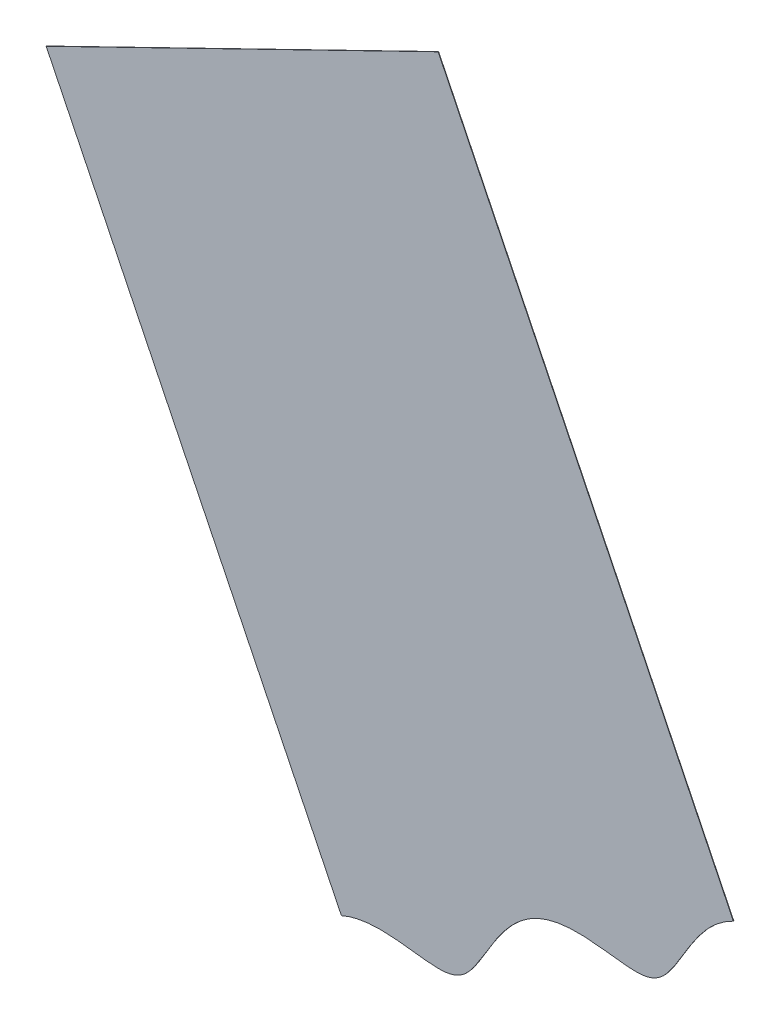
ISO-10303-21;
HEADER;
FILE_DESCRIPTION(('STEP AP214'),'2;1');
FILE_NAME('part.step','',(''),(''),'','','');
FILE_SCHEMA(('AUTOMOTIVE_DESIGN { 1 0 10303 214 1 1 1 1 }'));
ENDSEC;
DATA;
#1=APPLICATION_CONTEXT('core data for automotive mechanical design processes');
#2=APPLICATION_PROTOCOL_DEFINITION('international standard','automotive_design',2000,#1);
#3=PRODUCT_CONTEXT('',#1,'mechanical');
#4=PRODUCT('Part','Part','',(#3));
#5=PRODUCT_RELATED_PRODUCT_CATEGORY('part','',(#4));
#6=PRODUCT_DEFINITION_FORMATION('','',#4);
#7=PRODUCT_DEFINITION_CONTEXT('part definition',#1,'design');
#8=PRODUCT_DEFINITION('design','',#6,#7);
#9=PRODUCT_DEFINITION_SHAPE('','',#8);
#10=(LENGTH_UNIT() NAMED_UNIT(*) SI_UNIT(.MILLI.,.METRE.));
#11=(NAMED_UNIT(*) PLANE_ANGLE_UNIT() SI_UNIT($,.RADIAN.));
#12=(NAMED_UNIT(*) SI_UNIT($,.STERADIAN.) SOLID_ANGLE_UNIT());
#13=UNCERTAINTY_MEASURE_WITH_UNIT(LENGTH_MEASURE(1.E-05),#10,'distance_accuracy_value','');
#14=(GEOMETRIC_REPRESENTATION_CONTEXT(3) GLOBAL_UNCERTAINTY_ASSIGNED_CONTEXT((#13)) GLOBAL_UNIT_ASSIGNED_CONTEXT((#10,
#11,#12)) REPRESENTATION_CONTEXT('',''));
#15=CARTESIAN_POINT('',(0.,0.,0.));
#16=DIRECTION('',(0.,0.,1.));
#17=DIRECTION('',(1.,0.,0.));
#18=AXIS2_PLACEMENT_3D('',#15,#16,#17);
#19=CARTESIAN_POINT('',(-359.990822465181,15.681954726238,-15.85));
#20=DIRECTION('',(0.898794046299168,0.438371146789075,0.));
#21=DIRECTION('',(-0.438371146789075,0.898794046299168,0.));
#22=AXIS2_PLACEMENT_3D('',#19,#20,#21);
#23=PLANE('',#22);
#24=DIRECTION('',(0.,0.,-1.));
#25=VECTOR('',#24,1.);
#26=CARTESIAN_POINT('',(-426.886697836341,152.838824985538,-15.8499999999999));
#27=LINE('',#26,#25);
#28=CARTESIAN_POINT('',(-426.886697836341,152.838824985538,-15.7499999999999));
#29=VERTEX_POINT('',#28);
#30=CARTESIAN_POINT('',(-426.886697836341,152.838824985538,-15.8499999999999));
#31=VERTEX_POINT('',#30);
#32=EDGE_CURVE('E207',#29,#31,#27,.T.);
#33=ORIENTED_EDGE('',*,*,#32,.F.);
#34=DIRECTION('',(-0.438371146789075,0.898794046299168,0.));
#35=VECTOR('',#34,1.);
#36=CARTESIAN_POINT('',(-359.990822465181,15.681954726238,-15.75));
#37=LINE('',#36,#35);
#38=CARTESIAN_POINT('',(-359.990822465181,15.681954726238,-15.75));
#39=VERTEX_POINT('',#38);
#40=EDGE_CURVE('E122',#39,#29,#37,.T.);
#41=ORIENTED_EDGE('',*,*,#40,.F.);
#42=DIRECTION('',(0.,0.,-1.));
#43=VECTOR('',#42,1.);
#44=CARTESIAN_POINT('',(-359.990822465181,15.681954726238,-15.85));
#45=LINE('',#44,#43);
#46=CARTESIAN_POINT('',(-359.990822465181,15.681954726238,-15.85));
#47=VERTEX_POINT('',#46);
#48=EDGE_CURVE('E75',#39,#47,#45,.T.);
#49=ORIENTED_EDGE('',*,*,#48,.T.);
#50=DIRECTION('',(-0.438371146789075,0.898794046299168,0.));
#51=VECTOR('',#50,1.);
#52=CARTESIAN_POINT('',(-359.990822465181,15.681954726238,-15.85));
#53=LINE('',#52,#51);
#54=EDGE_CURVE('E212',#47,#31,#53,.T.);
#55=ORIENTED_EDGE('',*,*,#54,.T.);
#56=EDGE_LOOP('',(#33,#41,#49,#55));
#57=FACE_BOUND('',#56,.T.);
#58=ADVANCED_FACE('F55',(#57),#23,.T.);
#59=CARTESIAN_POINT('',(-359.990822465181,15.681954726238,-15.85));
#60=DIRECTION('',(0.,0.,1.));
#61=DIRECTION('',(1.,0.,0.));
#62=AXIS2_PLACEMENT_3D('',#59,#60,#61);
#63=PLANE('',#62);
#64=DIRECTION('',(-0.898794046299168,-0.438371146789075,0.));
#65=VECTOR('',#64,1.);
#66=CARTESIAN_POINT('',(-359.990822465181,15.681954726238,-15.85));
#67=LINE('',#66,#65);
#68=CARTESIAN_POINT('',(-360.080701869811,15.6381176115591,-15.85));
#69=VERTEX_POINT('',#68);
#70=EDGE_CURVE('E94',#47,#69,#67,.T.);
#71=ORIENTED_EDGE('',*,*,#70,.T.);
#72=CARTESIAN_POINT('',(-448.808314547158,-27.6470163030571,-15.8500000000004));
#73=CARTESIAN_POINT('',(-446.990055156415,-26.8385646669255,-15.8500000000004));
#74=CARTESIAN_POINT('',(-445.118408130527,-26.3498067563562,-15.8500000000004));
#75=CARTESIAN_POINT('',(-441.956215832941,-25.9955585201085,-15.8500000000004));
#76=CARTESIAN_POINT('',(-440.843596078941,-25.9427124163437,-15.8500000000004));
#77=CARTESIAN_POINT('',(-439.044157286053,-25.9582435176128,-15.8500000000004));
#78=CARTESIAN_POINT('',(-438.428154134507,-25.9791980914808,-15.8500000000004));
#79=CARTESIAN_POINT('',(-437.095964698823,-26.0558334275879,-15.8500000000003));
#80=CARTESIAN_POINT('',(-436.386957770754,-26.1111784138562,-15.8500000000003));
#81=CARTESIAN_POINT('',(-435.447058847886,-26.20164379446,-15.8500000000003));
#82=CARTESIAN_POINT('',(-435.250965148212,-26.2214258879279,-15.8500000000003));
#83=CARTESIAN_POINT('',(-434.780031051739,-26.2715594047868,-15.8500000000003));
#84=CARTESIAN_POINT('',(-434.513898151726,-26.3009092396466,-15.8500000000003));
#85=CARTESIAN_POINT('',(-433.623501896362,-26.4018079735172,-15.8500000000003));
#86=CARTESIAN_POINT('',(-432.896126216993,-26.4878918031717,-15.8500000000003));
#87=CARTESIAN_POINT('',(-431.241344377423,-26.6874542871937,-15.8500000000003));
#88=CARTESIAN_POINT('',(-430.52960220322,-26.7682246519776,-15.8500000000003));
#89=CARTESIAN_POINT('',(-429.635462060287,-26.8608638833127,-15.8500000000003));
#90=CARTESIAN_POINT('',(-429.366327532371,-26.8869909077843,-15.8500000000003));
#91=CARTESIAN_POINT('',(-428.885882849331,-26.9297395181139,-15.8500000000003));
#92=CARTESIAN_POINT('',(-428.681409805072,-26.9456817956228,-15.8500000000003));
#93=CARTESIAN_POINT('',(-427.660663718231,-27.0158317194351,-15.8500000000003));
#94=CARTESIAN_POINT('',(-426.92598935142,-27.0337302646178,-15.8500000000003));
#95=CARTESIAN_POINT('',(-425.62048562312,-26.9930845672494,-15.8500000000003));
#96=CARTESIAN_POINT('',(-425.061074692513,-26.9355642494527,-15.8500000000003));
#97=CARTESIAN_POINT('',(-423.984513295333,-26.733177977661,-15.8500000000003));
#98=CARTESIAN_POINT('',(-423.479984572632,-26.5894438530855,-15.8500000000003));
#99=CARTESIAN_POINT('',(-422.538431079008,-26.2168936265752,-15.8500000000003));
#100=CARTESIAN_POINT('',(-422.110463321187,-25.9931075687931,-15.8500000000003));
#101=CARTESIAN_POINT('',(-421.263862376416,-25.4281476206165,-15.8500000000003));
#102=CARTESIAN_POINT('',(-420.846892486992,-25.0878974850954,-15.8500000000003));
#103=CARTESIAN_POINT('',(-420.230933527296,-24.4908670396646,-15.8500000000003));
#104=CARTESIAN_POINT('',(-420.027196519804,-24.2774143508294,-15.8500000000003));
#105=CARTESIAN_POINT('',(-419.622887796302,-23.8216238924427,-15.8500000000003));
#106=CARTESIAN_POINT('',(-419.422941697803,-23.5800483361136,-15.8500000000003));
#107=CARTESIAN_POINT('',(-418.787046842851,-22.7622804011177,-15.8500000000003));
#108=CARTESIAN_POINT('',(-418.328547951603,-22.1095021389298,-15.8500000000003));
#109=CARTESIAN_POINT('',(-417.71221310261,-21.1590297626234,-15.8500000000003));
#110=CARTESIAN_POINT('',(-417.60172025257,-20.9866771704775,-15.8500000000003));
#111=CARTESIAN_POINT('',(-417.247126272328,-20.4167163204874,-15.8500000000003));
#112=CARTESIAN_POINT('',(-417.01437547428,-20.037702834407,-15.8500000000003));
#113=CARTESIAN_POINT('',(-416.58206856532,-19.3281330136587,-15.8500000000003));
#114=CARTESIAN_POINT('',(-416.424102810351,-19.0681014748046,-15.8500000000003));
#115=CARTESIAN_POINT('',(-416.080444396451,-18.5010218665539,-15.8500000000003));
#116=CARTESIAN_POINT('',(-415.887362970361,-18.1808868007265,-15.8500000000003));
#117=CARTESIAN_POINT('',(-415.328409954187,-17.2595616301395,-15.8500000000003));
#118=CARTESIAN_POINT('',(-414.990200853061,-16.7105074813062,-15.8500000000003));
#119=CARTESIAN_POINT('',(-414.534526565858,-15.9846702053933,-15.8500000000003));
#120=CARTESIAN_POINT('',(-414.391241697538,-15.7590151046452,-15.8500000000003));
#121=CARTESIAN_POINT('',(-414.121885082394,-15.3402862189279,-15.8500000000003));
#122=CARTESIAN_POINT('',(-413.997491520333,-15.1498390017393,-15.8500000000002));
#123=CARTESIAN_POINT('',(-413.617734321288,-14.5766652511485,-15.8500000000002));
#124=CARTESIAN_POINT('',(-413.365457657087,-14.2072311750782,-15.8500000000002));
#125=CARTESIAN_POINT('',(-412.611312069969,-13.1369742198385,-15.8500000000002));
#126=CARTESIAN_POINT('',(-412.112127552537,-12.4741966136401,-15.8500000000002));
#127=CARTESIAN_POINT('',(-410.625311622183,-10.6380448869285,-15.8500000000002));
#128=CARTESIAN_POINT('',(-409.667265830106,-9.63861730094909,-15.8500000000002));
#129=CARTESIAN_POINT('',(-407.639326369648,-7.88335198568563,-15.8500000000002));
#130=CARTESIAN_POINT('',(-406.578806161419,-7.13833861554849,-15.8500000000002));
#131=CARTESIAN_POINT('',(-404.364664788957,-5.91355045026343,-15.8500000000002));
#132=CARTESIAN_POINT('',(-403.209155644231,-5.43288416413357,-15.8500000000002));
#133=CARTESIAN_POINT('',(-400.719654379583,-4.6964733837338,-15.8500000000002));
#134=CARTESIAN_POINT('',(-399.396277479736,-4.44574132100071,-15.8500000000002));
#135=CARTESIAN_POINT('',(-397.293272728682,-4.24585321810124,-15.8500000000002));
#136=CARTESIAN_POINT('',(-396.561323891727,-4.20705685797228,-15.8500000000002));
#137=CARTESIAN_POINT('',(-395.030270322621,-4.18441470125215,-15.8500000000002));
#138=CARTESIAN_POINT('',(-394.241943465657,-4.20029901244286,-15.8500000000002));
#139=CARTESIAN_POINT('',(-392.946570919714,-4.26800400396982,-15.8500000000002));
#140=CARTESIAN_POINT('',(-392.497812844306,-4.29781336598792,-15.8500000000001));
#141=CARTESIAN_POINT('',(-391.799224891054,-4.35338895627875,-15.8500000000001));
#142=CARTESIAN_POINT('',(-391.562120433281,-4.37372441091965,-15.8500000000001));
#143=CARTESIAN_POINT('',(-391.079427904353,-4.41801583595598,-15.8500000000001));
#144=CARTESIAN_POINT('',(-390.826480772216,-4.44279327104504,-15.8500000000001));
#145=CARTESIAN_POINT('',(-389.938990370086,-4.53549647002018,-15.8500000000001));
#146=CARTESIAN_POINT('',(-389.211394510453,-4.61781963166185,-15.8500000000001));
#147=CARTESIAN_POINT('',(-387.916097333685,-4.77208591761173,-15.8500000000001));
#148=CARTESIAN_POINT('',(-387.439845859526,-4.83022639446094,-15.8500000000001));
#149=CARTESIAN_POINT('',(-386.606628422974,-4.92845080368494,-15.8500000000001));
#150=CARTESIAN_POINT('',(-386.227394784857,-4.97190212697479,-15.8500000000001));
#151=CARTESIAN_POINT('',(-385.54367766894,-5.04748301091018,-15.8500000000001));
#152=CARTESIAN_POINT('',(-385.239194191139,-5.07961257155572,-15.8500000000001));
#153=CARTESIAN_POINT('',(-384.704977395856,-5.13254993020249,-15.8500000000001));
#154=CARTESIAN_POINT('',(-384.484936086905,-5.15232944929801,-15.8500000000001));
#155=CARTESIAN_POINT('',(-383.863438626956,-5.20248325489285,-15.8500000000001));
#156=CARTESIAN_POINT('',(-383.470020858415,-5.22691804912205,-15.8500000000001));
#157=CARTESIAN_POINT('',(-382.352509167067,-5.27321920330758,-15.8500000000001));
#158=CARTESIAN_POINT('',(-381.691156858534,-5.26808233476184,-15.8500000000001));
#159=CARTESIAN_POINT('',(-379.958066390033,-5.14465881511635,-15.8500000000001));
#160=CARTESIAN_POINT('',(-378.955945853028,-4.9067770563509,-15.8500000000001));
#161=CARTESIAN_POINT('',(-377.644463124036,-4.31411484290502,-15.8500000000001));
#162=CARTESIAN_POINT('',(-377.235267604454,-4.07430635864986,-15.8500000000001));
#163=CARTESIAN_POINT('',(-376.417118831223,-3.4819685501698,-15.8500000000001));
#164=CARTESIAN_POINT('',(-376.016045342512,-3.13343114492265,-15.8500000000001));
#165=CARTESIAN_POINT('',(-375.229900160896,-2.33161933241413,-15.8500000000001));
#166=CARTESIAN_POINT('',(-374.848300582015,-1.8823921592849,-15.8500000000001));
#167=CARTESIAN_POINT('',(-374.218002976194,-1.04852091385975,-15.8500000000001));
#168=CARTESIAN_POINT('',(-374.001109549242,-0.74722054687314,-15.8500000000001));
#169=CARTESIAN_POINT('',(-373.665578071294,-0.260255068625903,-15.8500000000001));
#170=CARTESIAN_POINT('',(-373.552035689059,-0.0920974212489504,-15.8500000000001));
#171=CARTESIAN_POINT('',(-373.321553812081,0.255889516094092,-15.8500000000001));
#172=CARTESIAN_POINT('',(-373.212779256846,0.422471809399005,-15.8500000000001));
#173=CARTESIAN_POINT('',(-372.818503774527,1.04170549793848,-15.8500000000001));
#174=CARTESIAN_POINT('',(-372.442733641792,1.65005197716837,-15.8500000000001));
#175=CARTESIAN_POINT('',(-371.831871211885,2.65489010146021,-15.8500000000001));
#176=CARTESIAN_POINT('',(-371.702641237705,2.86807797758128,-15.8500000000001));
#177=CARTESIAN_POINT('',(-371.430066312945,3.3188942323489,-15.8500000000001));
#178=CARTESIAN_POINT('',(-371.285122918652,3.55935640830486,-15.8500000000001));
#179=CARTESIAN_POINT('',(-370.877995707947,4.23075498280833,-15.8500000000001));
#180=CARTESIAN_POINT('',(-370.627808397835,4.63954860036512,-15.8500000000001));
#181=CARTESIAN_POINT('',(-370.169895438327,5.37952497125433,-15.8500000000001));
#182=CARTESIAN_POINT('',(-369.962169788932,5.71070772458674,-15.85));
#183=CARTESIAN_POINT('',(-369.589180150858,6.29546236702719,-15.85));
#184=CARTESIAN_POINT('',(-369.422503303736,6.55131006997017,-15.85));
#185=CARTESIAN_POINT('',(-368.908741023766,7.32715081536852,-15.85));
#186=CARTESIAN_POINT('',(-368.573522787639,7.81420706538172,-15.85));
#187=CARTESIAN_POINT('',(-367.917666216422,8.72797773823676,-15.85));
#188=CARTESIAN_POINT('',(-367.599598762557,9.15115215827444,-15.85));
#189=CARTESIAN_POINT('',(-366.959040891141,9.96332537199563,-15.85));
#190=CARTESIAN_POINT('',(-366.637788802318,10.3506190354989,-15.85));
#191=CARTESIAN_POINT('',(-365.671113076503,11.456121195937,-15.85));
#192=CARTESIAN_POINT('',(-365.024665074821,12.1158886191028,-15.85));
#193=CARTESIAN_POINT('',(-363.026695921464,13.9207636739658,-15.85));
#194=CARTESIAN_POINT('',(-361.643579732682,14.8691801452441,-15.85));
#195=CARTESIAN_POINT('',(-360.080701869811,15.6381176115591,-15.85));
#196=B_SPLINE_CURVE_WITH_KNOTS('',3,(#72,#73,#74,#75,#76,#77,#78,#79,#80,#81,#82,#83,#84,#85,
#86,#87,#88,#89,#90,#91,#92,#93,#94,#95,#96,#97,#98,#99,#100,#101,#102,#103,#104,#105,#106,#107,
#108,#109,#110,#111,#112,#113,#114,#115,#116,#117,#118,#119,#120,#121,#122,#123,#124,#125,#126,
#127,#128,#129,#130,#131,#132,#133,#134,#135,#136,#137,#138,#139,#140,#141,#142,#143,#144,#145,
#146,#147,#148,#149,#150,#151,#152,#153,#154,#155,#156,#157,#158,#159,#160,#161,#162,#163,#164,
#165,#166,#167,#168,#169,#170,#171,#172,#173,#174,#175,#176,#177,#178,#179,#180,#181,#182,#183,
#184,#185,#186,#187,#188,#189,#190,#191,#192,#193,#194,#195),.UNSPECIFIED.,.F.,.F.,(4,2,2,2,2,2,
2,2,2,2,2,2,2,2,2,2,2,2,2,2,2,2,2,2,2,2,2,2,2,2,2,2,2,2,2,2,2,2,2,2,2,2,2,2,2,2,2,2,2,2,2,2,2,2,
2,2,2,2,2,2,2,4),(0.,0.125,0.1875,0.21875,0.25,0.2578125,0.265625,0.28125,0.296875,0.3046875,
0.3125,0.34375,0.375,0.40625,0.4375,0.46875,0.484375,0.5,0.53125,0.5390625,0.546875,0.55078125,
0.5546875,0.5625,0.56640625,0.5703125,0.578125,0.59375,0.625,0.65625,0.6875,0.71875,0.734375,
0.75,0.7578125,0.76171875,0.765625,0.7734375,0.77734375,0.78125,0.78515625,0.7890625,0.796875,
0.8125,0.84375,0.859375,0.875,0.890625,0.8984375,0.90234375,0.90625,0.9140625,0.916015625,
0.91796875,0.921875,0.92578125,0.9296875,0.9375,0.9453125,0.953125,0.96875,1.),.UNSPECIFIED.);
#197=CARTESIAN_POINT('',(-448.808314547158,-27.6470163030571,-15.8500000000004));
#198=VERTEX_POINT('',#197);
#199=EDGE_CURVE('E133',#69,#198,#196,.F.);
#200=ORIENTED_EDGE('',*,*,#199,.T.);
#201=DIRECTION('',(-0.438371146789076,0.898794046299168,0.));
#202=VECTOR('',#201,1.);
#203=CARTESIAN_POINT('',(-448.808314547158,-27.6470163030571,-15.8500000000004));
#204=LINE('',#203,#202);
#205=CARTESIAN_POINT('',(-515.708045539186,109.517759150521,-15.8500000000003));
#206=VERTEX_POINT('',#205);
#207=EDGE_CURVE('E129',#198,#206,#204,.T.);
#208=ORIENTED_EDGE('',*,*,#207,.T.);
#209=DIRECTION('',(-0.898794046299168,-0.438371146789075,0.));
#210=VECTOR('',#209,1.);
#211=CARTESIAN_POINT('',(-426.886697836341,152.838824985538,-15.8499999999999));
#212=LINE('',#211,#210);
#213=EDGE_CURVE('E101',#31,#206,#212,.T.);
#214=ORIENTED_EDGE('',*,*,#213,.F.);
#215=ORIENTED_EDGE('',*,*,#54,.F.);
#216=EDGE_LOOP('',(#71,#200,#208,#214,#215));
#217=FACE_BOUND('',#216,.T.);
#218=ADVANCED_FACE('F234',(#217),#63,.F.);
#219=CARTESIAN_POINT('',(-426.886697836341,152.838824985538,-15.8499999999999));
#220=DIRECTION('',(-0.438371146789075,0.898794046299168,0.));
#221=DIRECTION('',(-0.898794046299168,-0.438371146789075,0.));
#222=AXIS2_PLACEMENT_3D('',#219,#220,#221);
#223=PLANE('',#222);
#224=ORIENTED_EDGE('',*,*,#213,.T.);
#225=DIRECTION('',(0.,0.,-1.));
#226=VECTOR('',#225,1.);
#227=CARTESIAN_POINT('',(-515.708045539186,109.517759150521,-15.8000000000003));
#228=LINE('',#227,#226);
#229=CARTESIAN_POINT('',(-515.708045539186,109.517759150521,-15.7500000000003));
#230=VERTEX_POINT('',#229);
#231=EDGE_CURVE('E125',#230,#206,#228,.T.);
#232=ORIENTED_EDGE('',*,*,#231,.F.);
#233=DIRECTION('',(-0.898794046299168,-0.438371146789075,0.));
#234=VECTOR('',#233,1.);
#235=CARTESIAN_POINT('',(-426.886697836341,152.838824985538,-15.7499999999999));
#236=LINE('',#235,#234);
#237=EDGE_CURVE('E116',#29,#230,#236,.T.);
#238=ORIENTED_EDGE('',*,*,#237,.F.);
#239=ORIENTED_EDGE('',*,*,#32,.T.);
#240=EDGE_LOOP('',(#224,#232,#238,#239));
#241=FACE_BOUND('',#240,.T.);
#242=ADVANCED_FACE('F126',(#241),#223,.T.);
#243=CARTESIAN_POINT('',(-359.990822465181,15.681954726238,-15.75));
#244=DIRECTION('',(0.,0.,1.));
#245=DIRECTION('',(1.,0.,0.));
#246=AXIS2_PLACEMENT_3D('',#243,#244,#245);
#247=PLANE('',#246);
#248=ORIENTED_EDGE('',*,*,#237,.T.);
#249=DIRECTION('',(-0.438371146789076,0.898794046299168,0.));
#250=VECTOR('',#249,1.);
#251=CARTESIAN_POINT('',(-448.808314547158,-27.6470163030571,-15.7500000000004));
#252=LINE('',#251,#250);
#253=CARTESIAN_POINT('',(-448.808314547158,-27.6470163030571,-15.7500000000004));
#254=VERTEX_POINT('',#253);
#255=EDGE_CURVE('E119',#254,#230,#252,.T.);
#256=ORIENTED_EDGE('',*,*,#255,.F.);
#257=CARTESIAN_POINT('',(-360.080701869811,15.6381176115591,-15.75));
#258=CARTESIAN_POINT('',(-361.643579732682,14.8691801452441,-15.75));
#259=CARTESIAN_POINT('',(-363.026695921464,13.9207636739658,-15.75));
#260=CARTESIAN_POINT('',(-365.024665074821,12.1158886191028,-15.75));
#261=CARTESIAN_POINT('',(-365.671113076503,11.456121195937,-15.75));
#262=CARTESIAN_POINT('',(-366.637788802318,10.3506190354989,-15.75));
#263=CARTESIAN_POINT('',(-366.959040891141,9.96332537199563,-15.75));
#264=CARTESIAN_POINT('',(-367.599598762557,9.15115215827444,-15.75));
#265=CARTESIAN_POINT('',(-367.917666216422,8.72797773823676,-15.75));
#266=CARTESIAN_POINT('',(-368.573522787639,7.81420706538172,-15.75));
#267=CARTESIAN_POINT('',(-368.908741023766,7.32715081536852,-15.75));
#268=CARTESIAN_POINT('',(-369.422503303736,6.55131006997017,-15.75));
#269=CARTESIAN_POINT('',(-369.589180150858,6.29546236702719,-15.75));
#270=CARTESIAN_POINT('',(-369.962169788932,5.71070772458674,-15.75));
#271=CARTESIAN_POINT('',(-370.169895438327,5.37952497125433,-15.7500000000001));
#272=CARTESIAN_POINT('',(-370.627808397835,4.63954860036512,-15.7500000000001));
#273=CARTESIAN_POINT('',(-370.877995707947,4.23075498280833,-15.7500000000001));
#274=CARTESIAN_POINT('',(-371.285122918652,3.55935640830486,-15.7500000000001));
#275=CARTESIAN_POINT('',(-371.430066312945,3.3188942323489,-15.7500000000001));
#276=CARTESIAN_POINT('',(-371.702641237705,2.86807797758128,-15.7500000000001));
#277=CARTESIAN_POINT('',(-371.831871211885,2.65489010146021,-15.7500000000001));
#278=CARTESIAN_POINT('',(-372.442733641792,1.65005197716837,-15.7500000000001));
#279=CARTESIAN_POINT('',(-372.818503774527,1.04170549793848,-15.7500000000001));
#280=CARTESIAN_POINT('',(-373.212779256846,0.422471809399004,-15.7500000000001));
#281=CARTESIAN_POINT('',(-373.321553812081,0.255889516094092,-15.7500000000001));
#282=CARTESIAN_POINT('',(-373.552035689059,-0.0920974212489506,-15.7500000000001));
#283=CARTESIAN_POINT('',(-373.665578071294,-0.260255068625903,-15.7500000000001));
#284=CARTESIAN_POINT('',(-374.001109549242,-0.74722054687314,-15.7500000000001));
#285=CARTESIAN_POINT('',(-374.218002976194,-1.04852091385976,-15.7500000000001));
#286=CARTESIAN_POINT('',(-374.848300582015,-1.8823921592849,-15.7500000000001));
#287=CARTESIAN_POINT('',(-375.229900160896,-2.33161933241413,-15.7500000000001));
#288=CARTESIAN_POINT('',(-376.016045342512,-3.13343114492265,-15.7500000000001));
#289=CARTESIAN_POINT('',(-376.417118831223,-3.4819685501698,-15.7500000000001));
#290=CARTESIAN_POINT('',(-377.235267604454,-4.07430635864986,-15.7500000000001));
#291=CARTESIAN_POINT('',(-377.644463124036,-4.31411484290502,-15.7500000000001));
#292=CARTESIAN_POINT('',(-378.955945853028,-4.9067770563509,-15.7500000000001));
#293=CARTESIAN_POINT('',(-379.958066390033,-5.14465881511635,-15.7500000000001));
#294=CARTESIAN_POINT('',(-381.691156858534,-5.26808233476184,-15.7500000000001));
#295=CARTESIAN_POINT('',(-382.352509167067,-5.27321920330758,-15.7500000000001));
#296=CARTESIAN_POINT('',(-383.470020858415,-5.22691804912205,-15.7500000000001));
#297=CARTESIAN_POINT('',(-383.863438626956,-5.20248325489285,-15.7500000000001));
#298=CARTESIAN_POINT('',(-384.484936086905,-5.15232944929801,-15.7500000000001));
#299=CARTESIAN_POINT('',(-384.704977395856,-5.13254993020249,-15.7500000000001));
#300=CARTESIAN_POINT('',(-385.239194191139,-5.07961257155572,-15.7500000000001));
#301=CARTESIAN_POINT('',(-385.54367766894,-5.04748301091018,-15.7500000000001));
#302=CARTESIAN_POINT('',(-386.227394784857,-4.97190212697479,-15.7500000000001));
#303=CARTESIAN_POINT('',(-386.606628422974,-4.92845080368494,-15.7500000000001));
#304=CARTESIAN_POINT('',(-387.439845859526,-4.83022639446094,-15.7500000000001));
#305=CARTESIAN_POINT('',(-387.916097333685,-4.77208591761173,-15.7500000000001));
#306=CARTESIAN_POINT('',(-389.211394510453,-4.61781963166185,-15.7500000000001));
#307=CARTESIAN_POINT('',(-389.938990370086,-4.53549647002018,-15.7500000000001));
#308=CARTESIAN_POINT('',(-390.826480772216,-4.44279327104504,-15.7500000000001));
#309=CARTESIAN_POINT('',(-391.079427904353,-4.41801583595598,-15.7500000000001));
#310=CARTESIAN_POINT('',(-391.562120433281,-4.37372441091965,-15.7500000000001));
#311=CARTESIAN_POINT('',(-391.799224891054,-4.35338895627875,-15.7500000000001));
#312=CARTESIAN_POINT('',(-392.497812844306,-4.29781336598792,-15.7500000000001));
#313=CARTESIAN_POINT('',(-392.946570919714,-4.26800400396982,-15.7500000000001));
#314=CARTESIAN_POINT('',(-394.241943465657,-4.20029901244286,-15.7500000000002));
#315=CARTESIAN_POINT('',(-395.030270322621,-4.18441470125215,-15.7500000000002));
#316=CARTESIAN_POINT('',(-396.561323891727,-4.20705685797228,-15.7500000000002));
#317=CARTESIAN_POINT('',(-397.293272728682,-4.24585321810124,-15.7500000000002));
#318=CARTESIAN_POINT('',(-399.396277479736,-4.44574132100071,-15.7500000000002));
#319=CARTESIAN_POINT('',(-400.719654379583,-4.6964733837338,-15.7500000000002));
#320=CARTESIAN_POINT('',(-403.209155644231,-5.43288416413357,-15.7500000000002));
#321=CARTESIAN_POINT('',(-404.364664788957,-5.91355045026343,-15.7500000000002));
#322=CARTESIAN_POINT('',(-406.578806161419,-7.13833861554849,-15.7500000000002));
#323=CARTESIAN_POINT('',(-407.639326369648,-7.88335198568563,-15.7500000000002));
#324=CARTESIAN_POINT('',(-409.667265830106,-9.63861730094909,-15.7500000000002));
#325=CARTESIAN_POINT('',(-410.625311622183,-10.6380448869285,-15.7500000000002));
#326=CARTESIAN_POINT('',(-412.112127552537,-12.4741966136401,-15.7500000000002));
#327=CARTESIAN_POINT('',(-412.611312069969,-13.1369742198385,-15.7500000000002));
#328=CARTESIAN_POINT('',(-413.365457657087,-14.2072311750782,-15.7500000000002));
#329=CARTESIAN_POINT('',(-413.617734321288,-14.5766652511485,-15.7500000000002));
#330=CARTESIAN_POINT('',(-413.997491520333,-15.1498390017393,-15.7500000000002));
#331=CARTESIAN_POINT('',(-414.121885082394,-15.3402862189279,-15.7500000000002));
#332=CARTESIAN_POINT('',(-414.391241697538,-15.7590151046452,-15.7500000000002));
#333=CARTESIAN_POINT('',(-414.534526565858,-15.9846702053933,-15.7500000000002));
#334=CARTESIAN_POINT('',(-414.990200853061,-16.7105074813062,-15.7500000000003));
#335=CARTESIAN_POINT('',(-415.328409954187,-17.2595616301395,-15.7500000000003));
#336=CARTESIAN_POINT('',(-415.887362970361,-18.1808868007265,-15.7500000000003));
#337=CARTESIAN_POINT('',(-416.080444396451,-18.5010218665539,-15.7500000000003));
#338=CARTESIAN_POINT('',(-416.424102810351,-19.0681014748046,-15.7500000000003));
#339=CARTESIAN_POINT('',(-416.58206856532,-19.3281330136587,-15.7500000000003));
#340=CARTESIAN_POINT('',(-417.01437547428,-20.037702834407,-15.7500000000003));
#341=CARTESIAN_POINT('',(-417.247126272328,-20.4167163204874,-15.7500000000003));
#342=CARTESIAN_POINT('',(-417.60172025257,-20.9866771704775,-15.7500000000003));
#343=CARTESIAN_POINT('',(-417.71221310261,-21.1590297626234,-15.7500000000003));
#344=CARTESIAN_POINT('',(-418.328547951603,-22.1095021389298,-15.7500000000003));
#345=CARTESIAN_POINT('',(-418.787046842851,-22.7622804011177,-15.7500000000003));
#346=CARTESIAN_POINT('',(-419.422941697803,-23.5800483361136,-15.7500000000003));
#347=CARTESIAN_POINT('',(-419.622887796302,-23.8216238924427,-15.7500000000003));
#348=CARTESIAN_POINT('',(-420.027196519804,-24.2774143508294,-15.7500000000003));
#349=CARTESIAN_POINT('',(-420.230933527296,-24.4908670396646,-15.7500000000003));
#350=CARTESIAN_POINT('',(-420.846892486992,-25.0878974850954,-15.7500000000003));
#351=CARTESIAN_POINT('',(-421.263862376416,-25.4281476206165,-15.7500000000003));
#352=CARTESIAN_POINT('',(-422.110463321187,-25.9931075687931,-15.7500000000003));
#353=CARTESIAN_POINT('',(-422.538431079008,-26.2168936265752,-15.7500000000003));
#354=CARTESIAN_POINT('',(-423.479984572632,-26.5894438530855,-15.7500000000003));
#355=CARTESIAN_POINT('',(-423.984513295333,-26.733177977661,-15.7500000000003));
#356=CARTESIAN_POINT('',(-425.061074692513,-26.9355642494527,-15.7500000000003));
#357=CARTESIAN_POINT('',(-425.62048562312,-26.9930845672494,-15.7500000000003));
#358=CARTESIAN_POINT('',(-426.92598935142,-27.0337302646178,-15.7500000000003));
#359=CARTESIAN_POINT('',(-427.660663718231,-27.0158317194351,-15.7500000000003));
#360=CARTESIAN_POINT('',(-428.681409805072,-26.9456817956228,-15.7500000000003));
#361=CARTESIAN_POINT('',(-428.885882849331,-26.9297395181139,-15.7500000000003));
#362=CARTESIAN_POINT('',(-429.366327532371,-26.8869909077843,-15.7500000000003));
#363=CARTESIAN_POINT('',(-429.635462060287,-26.8608638833127,-15.7500000000003));
#364=CARTESIAN_POINT('',(-430.52960220322,-26.7682246519776,-15.7500000000003));
#365=CARTESIAN_POINT('',(-431.241344377423,-26.6874542871937,-15.7500000000003));
#366=CARTESIAN_POINT('',(-432.896126216993,-26.4878918031717,-15.7500000000003));
#367=CARTESIAN_POINT('',(-433.623501896362,-26.4018079735172,-15.7500000000003));
#368=CARTESIAN_POINT('',(-434.513898151726,-26.3009092396466,-15.7500000000003));
#369=CARTESIAN_POINT('',(-434.780031051739,-26.2715594047868,-15.7500000000003));
#370=CARTESIAN_POINT('',(-435.250965148212,-26.2214258879279,-15.7500000000003));
#371=CARTESIAN_POINT('',(-435.447058847886,-26.20164379446,-15.7500000000003));
#372=CARTESIAN_POINT('',(-436.386957770754,-26.1111784138562,-15.7500000000003));
#373=CARTESIAN_POINT('',(-437.095964698823,-26.0558334275879,-15.7500000000003));
#374=CARTESIAN_POINT('',(-438.428154134507,-25.9791980914808,-15.7500000000004));
#375=CARTESIAN_POINT('',(-439.044157286053,-25.9582435176128,-15.7500000000004));
#376=CARTESIAN_POINT('',(-440.843596078941,-25.9427124163437,-15.7500000000004));
#377=CARTESIAN_POINT('',(-441.956215832941,-25.9955585201085,-15.7500000000004));
#378=CARTESIAN_POINT('',(-445.118408130527,-26.3498067563562,-15.7500000000004));
#379=CARTESIAN_POINT('',(-446.990055156415,-26.8385646669255,-15.7500000000004));
#380=CARTESIAN_POINT('',(-448.808314547158,-27.6470163030571,-15.7500000000004));
#381=B_SPLINE_CURVE_WITH_KNOTS('',3,(#257,#258,#259,#260,#261,#262,#263,#264,#265,#266,#267,
#268,#269,#270,#271,#272,#273,#274,#275,#276,#277,#278,#279,#280,#281,#282,#283,#284,#285,#286,
#287,#288,#289,#290,#291,#292,#293,#294,#295,#296,#297,#298,#299,#300,#301,#302,#303,#304,#305,
#306,#307,#308,#309,#310,#311,#312,#313,#314,#315,#316,#317,#318,#319,#320,#321,#322,#323,#324,
#325,#326,#327,#328,#329,#330,#331,#332,#333,#334,#335,#336,#337,#338,#339,#340,#341,#342,#343,
#344,#345,#346,#347,#348,#349,#350,#351,#352,#353,#354,#355,#356,#357,#358,#359,#360,#361,#362,
#363,#364,#365,#366,#367,#368,#369,#370,#371,#372,#373,#374,#375,#376,#377,#378,#379,#380),
.UNSPECIFIED.,.F.,.F.,(4,2,2,2,2,2,2,2,2,2,2,2,2,2,2,2,2,2,2,2,2,2,2,2,2,2,2,2,2,2,2,2,2,2,2,2,
2,2,2,2,2,2,2,2,2,2,2,2,2,2,2,2,2,2,2,2,2,2,2,2,2,4),(0.,0.03125,0.046875,0.0546875,0.0625,
0.0703125,0.07421875,0.078125,0.08203125,0.083984375,0.0859375,0.09375,0.09765625,0.1015625,
0.109375,0.125,0.140625,0.15625,0.1875,0.203125,0.2109375,0.21484375,0.21875,0.22265625,
0.2265625,0.234375,0.23828125,0.2421875,0.25,0.265625,0.28125,0.3125,0.34375,0.375,0.40625,
0.421875,0.4296875,0.43359375,0.4375,0.4453125,0.44921875,0.453125,0.4609375,0.46875,0.5,
0.515625,0.53125,0.5625,0.59375,0.625,0.65625,0.6875,0.6953125,0.703125,0.71875,0.734375,
0.7421875,0.75,0.78125,0.8125,0.875,1.),.UNSPECIFIED.);
#382=CARTESIAN_POINT('',(-360.080701869811,15.6381176115591,-15.75));
#383=VERTEX_POINT('',#382);
#384=EDGE_CURVE('E134',#383,#254,#381,.T.);
#385=ORIENTED_EDGE('',*,*,#384,.F.);
#386=DIRECTION('',(-0.898794046299168,-0.438371146789075,0.));
#387=VECTOR('',#386,1.);
#388=CARTESIAN_POINT('',(-359.990822465181,15.681954726238,-15.75));
#389=LINE('',#388,#387);
#390=EDGE_CURVE('E67',#39,#383,#389,.T.);
#391=ORIENTED_EDGE('',*,*,#390,.F.);
#392=ORIENTED_EDGE('',*,*,#40,.T.);
#393=EDGE_LOOP('',(#248,#256,#385,#391,#392));
#394=FACE_BOUND('',#393,.T.);
#395=ADVANCED_FACE('F117',(#394),#247,.T.);
#396=CARTESIAN_POINT('',(-359.990822465181,15.681954726238,-15.85));
#397=DIRECTION('',(-0.438371146789075,0.898794046299168,0.));
#398=DIRECTION('',(-0.898794046299168,-0.438371146789075,0.));
#399=AXIS2_PLACEMENT_3D('',#396,#397,#398);
#400=PLANE('',#399);
#401=ORIENTED_EDGE('',*,*,#48,.F.);
#402=ORIENTED_EDGE('',*,*,#390,.T.);
#403=CARTESIAN_POINT('',(-360.080701869811,15.6381176115591,-15.85));
#404=CARTESIAN_POINT('',(-360.080701869811,15.6381176115591,-15.75));
#405=B_SPLINE_CURVE_WITH_KNOTS('',1,(#403,#404),.UNSPECIFIED.,.F.,.F.,(2,2),(0.,1.),.UNSPECIFIED.);
#406=EDGE_CURVE('E12',#383,#69,#405,.F.);
#407=ORIENTED_EDGE('',*,*,#406,.T.);
#408=ORIENTED_EDGE('',*,*,#70,.F.);
#409=EDGE_LOOP('',(#401,#402,#407,#408));
#410=FACE_BOUND('',#409,.T.);
#411=ADVANCED_FACE('F57',(#410),#400,.F.);
#412=CARTESIAN_POINT('',(-360.080701869811,15.6381176115591,-15.85));
#413=CARTESIAN_POINT('',(-361.643579732682,14.8691801452441,-15.85));
#414=CARTESIAN_POINT('',(-363.026695921464,13.9207636739658,-15.85));
#415=CARTESIAN_POINT('',(-365.024665074821,12.1158886191028,-15.85));
#416=CARTESIAN_POINT('',(-365.671113076503,11.456121195937,-15.85));
#417=CARTESIAN_POINT('',(-366.637788802318,10.3506190354989,-15.85));
#418=CARTESIAN_POINT('',(-366.959040891141,9.96332537199563,-15.85));
#419=CARTESIAN_POINT('',(-367.599598762557,9.15115215827444,-15.85));
#420=CARTESIAN_POINT('',(-367.917666216422,8.72797773823676,-15.85));
#421=CARTESIAN_POINT('',(-368.573522787639,7.81420706538172,-15.85));
#422=CARTESIAN_POINT('',(-368.908741023766,7.32715081536852,-15.85));
#423=CARTESIAN_POINT('',(-369.422503303736,6.55131006997017,-15.85));
#424=CARTESIAN_POINT('',(-369.589180150858,6.29546236702719,-15.85));
#425=CARTESIAN_POINT('',(-369.962169788932,5.71070772458674,-15.85));
#426=CARTESIAN_POINT('',(-370.169895438327,5.37952497125433,-15.8500000000001));
#427=CARTESIAN_POINT('',(-370.627808397835,4.63954860036512,-15.8500000000001));
#428=CARTESIAN_POINT('',(-370.877995707947,4.23075498280833,-15.8500000000001));
#429=CARTESIAN_POINT('',(-371.285122918652,3.55935640830486,-15.8500000000001));
#430=CARTESIAN_POINT('',(-371.430066312945,3.3188942323489,-15.8500000000001));
#431=CARTESIAN_POINT('',(-371.702641237705,2.86807797758128,-15.8500000000001));
#432=CARTESIAN_POINT('',(-371.831871211885,2.65489010146021,-15.8500000000001));
#433=CARTESIAN_POINT('',(-372.442733641792,1.65005197716837,-15.8500000000001));
#434=CARTESIAN_POINT('',(-372.818503774527,1.04170549793848,-15.8500000000001));
#435=CARTESIAN_POINT('',(-373.212779256846,0.422471809399005,-15.8500000000001));
#436=CARTESIAN_POINT('',(-373.321553812081,0.255889516094092,-15.8500000000001));
#437=CARTESIAN_POINT('',(-373.552035689059,-0.0920974212489504,-15.8500000000001));
#438=CARTESIAN_POINT('',(-373.665578071294,-0.260255068625903,-15.8500000000001));
#439=CARTESIAN_POINT('',(-374.001109549242,-0.74722054687314,-15.8500000000001));
#440=CARTESIAN_POINT('',(-374.218002976194,-1.04852091385975,-15.8500000000001));
#441=CARTESIAN_POINT('',(-374.848300582015,-1.8823921592849,-15.8500000000001));
#442=CARTESIAN_POINT('',(-375.229900160896,-2.33161933241413,-15.8500000000001));
#443=CARTESIAN_POINT('',(-376.016045342512,-3.13343114492265,-15.8500000000001));
#444=CARTESIAN_POINT('',(-376.417118831223,-3.4819685501698,-15.8500000000001));
#445=CARTESIAN_POINT('',(-377.235267604454,-4.07430635864986,-15.8500000000001));
#446=CARTESIAN_POINT('',(-377.644463124036,-4.31411484290502,-15.8500000000001));
#447=CARTESIAN_POINT('',(-378.955945853028,-4.9067770563509,-15.8500000000001));
#448=CARTESIAN_POINT('',(-379.958066390033,-5.14465881511635,-15.8500000000001));
#449=CARTESIAN_POINT('',(-381.691156858534,-5.26808233476184,-15.8500000000001));
#450=CARTESIAN_POINT('',(-382.352509167067,-5.27321920330758,-15.8500000000001));
#451=CARTESIAN_POINT('',(-383.470020858415,-5.22691804912205,-15.8500000000001));
#452=CARTESIAN_POINT('',(-383.863438626956,-5.20248325489285,-15.8500000000001));
#453=CARTESIAN_POINT('',(-384.484936086905,-5.15232944929801,-15.8500000000001));
#454=CARTESIAN_POINT('',(-384.704977395856,-5.13254993020249,-15.8500000000001));
#455=CARTESIAN_POINT('',(-385.239194191139,-5.07961257155572,-15.8500000000001));
#456=CARTESIAN_POINT('',(-385.54367766894,-5.04748301091018,-15.8500000000001));
#457=CARTESIAN_POINT('',(-386.227394784857,-4.97190212697479,-15.8500000000001));
#458=CARTESIAN_POINT('',(-386.606628422974,-4.92845080368494,-15.8500000000001));
#459=CARTESIAN_POINT('',(-387.439845859526,-4.83022639446094,-15.8500000000001));
#460=CARTESIAN_POINT('',(-387.916097333685,-4.77208591761173,-15.8500000000001));
#461=CARTESIAN_POINT('',(-389.211394510453,-4.61781963166185,-15.8500000000001));
#462=CARTESIAN_POINT('',(-389.938990370086,-4.53549647002018,-15.8500000000001));
#463=CARTESIAN_POINT('',(-390.826480772216,-4.44279327104504,-15.8500000000001));
#464=CARTESIAN_POINT('',(-391.079427904353,-4.41801583595598,-15.8500000000001));
#465=CARTESIAN_POINT('',(-391.562120433281,-4.37372441091965,-15.8500000000001));
#466=CARTESIAN_POINT('',(-391.799224891054,-4.35338895627875,-15.8500000000001));
#467=CARTESIAN_POINT('',(-392.497812844306,-4.29781336598792,-15.8500000000001));
#468=CARTESIAN_POINT('',(-392.946570919714,-4.26800400396982,-15.8500000000002));
#469=CARTESIAN_POINT('',(-394.241943465657,-4.20029901244286,-15.8500000000002));
#470=CARTESIAN_POINT('',(-395.030270322621,-4.18441470125215,-15.8500000000002));
#471=CARTESIAN_POINT('',(-396.561323891727,-4.20705685797228,-15.8500000000002));
#472=CARTESIAN_POINT('',(-397.293272728682,-4.24585321810124,-15.8500000000002));
#473=CARTESIAN_POINT('',(-399.396277479736,-4.44574132100071,-15.8500000000002));
#474=CARTESIAN_POINT('',(-400.719654379583,-4.6964733837338,-15.8500000000002));
#475=CARTESIAN_POINT('',(-403.209155644231,-5.43288416413357,-15.8500000000002));
#476=CARTESIAN_POINT('',(-404.364664788957,-5.91355045026343,-15.8500000000002));
#477=CARTESIAN_POINT('',(-406.578806161419,-7.13833861554849,-15.8500000000002));
#478=CARTESIAN_POINT('',(-407.639326369648,-7.88335198568563,-15.8500000000002));
#479=CARTESIAN_POINT('',(-409.667265830106,-9.63861730094909,-15.8500000000002));
#480=CARTESIAN_POINT('',(-410.625311622183,-10.6380448869285,-15.8500000000002));
#481=CARTESIAN_POINT('',(-412.112127552537,-12.4741966136401,-15.8500000000002));
#482=CARTESIAN_POINT('',(-412.611312069969,-13.1369742198385,-15.8500000000002));
#483=CARTESIAN_POINT('',(-413.365457657087,-14.2072311750782,-15.8500000000002));
#484=CARTESIAN_POINT('',(-413.617734321288,-14.5766652511485,-15.8500000000002));
#485=CARTESIAN_POINT('',(-413.997491520333,-15.1498390017393,-15.8500000000002));
#486=CARTESIAN_POINT('',(-414.121885082394,-15.3402862189279,-15.8500000000003));
#487=CARTESIAN_POINT('',(-414.391241697538,-15.7590151046452,-15.8500000000003));
#488=CARTESIAN_POINT('',(-414.534526565858,-15.9846702053933,-15.8500000000003));
#489=CARTESIAN_POINT('',(-414.990200853061,-16.7105074813062,-15.8500000000003));
#490=CARTESIAN_POINT('',(-415.328409954187,-17.2595616301395,-15.8500000000003));
#491=CARTESIAN_POINT('',(-415.887362970361,-18.1808868007265,-15.8500000000003));
#492=CARTESIAN_POINT('',(-416.080444396451,-18.5010218665539,-15.8500000000003));
#493=CARTESIAN_POINT('',(-416.424102810351,-19.0681014748046,-15.8500000000003));
#494=CARTESIAN_POINT('',(-416.58206856532,-19.3281330136587,-15.8500000000003));
#495=CARTESIAN_POINT('',(-417.01437547428,-20.037702834407,-15.8500000000003));
#496=CARTESIAN_POINT('',(-417.247126272328,-20.4167163204874,-15.8500000000003));
#497=CARTESIAN_POINT('',(-417.60172025257,-20.9866771704775,-15.8500000000003));
#498=CARTESIAN_POINT('',(-417.71221310261,-21.1590297626234,-15.8500000000003));
#499=CARTESIAN_POINT('',(-418.328547951603,-22.1095021389298,-15.8500000000003));
#500=CARTESIAN_POINT('',(-418.787046842851,-22.7622804011177,-15.8500000000003));
#501=CARTESIAN_POINT('',(-419.422941697803,-23.5800483361136,-15.8500000000003));
#502=CARTESIAN_POINT('',(-419.622887796302,-23.8216238924427,-15.8500000000003));
#503=CARTESIAN_POINT('',(-420.027196519804,-24.2774143508294,-15.8500000000003));
#504=CARTESIAN_POINT('',(-420.230933527296,-24.4908670396646,-15.8500000000003));
#505=CARTESIAN_POINT('',(-420.846892486992,-25.0878974850954,-15.8500000000003));
#506=CARTESIAN_POINT('',(-421.263862376416,-25.4281476206165,-15.8500000000003));
#507=CARTESIAN_POINT('',(-422.110463321187,-25.9931075687931,-15.8500000000003));
#508=CARTESIAN_POINT('',(-422.538431079008,-26.2168936265752,-15.8500000000003));
#509=CARTESIAN_POINT('',(-423.479984572632,-26.5894438530855,-15.8500000000003));
#510=CARTESIAN_POINT('',(-423.984513295333,-26.733177977661,-15.8500000000003));
#511=CARTESIAN_POINT('',(-425.061074692513,-26.9355642494527,-15.8500000000003));
#512=CARTESIAN_POINT('',(-425.62048562312,-26.9930845672494,-15.8500000000003));
#513=CARTESIAN_POINT('',(-426.92598935142,-27.0337302646178,-15.8500000000003));
#514=CARTESIAN_POINT('',(-427.660663718231,-27.0158317194351,-15.8500000000003));
#515=CARTESIAN_POINT('',(-428.681409805072,-26.9456817956228,-15.8500000000003));
#516=CARTESIAN_POINT('',(-428.885882849331,-26.9297395181139,-15.8500000000003));
#517=CARTESIAN_POINT('',(-429.366327532371,-26.8869909077843,-15.8500000000003));
#518=CARTESIAN_POINT('',(-429.635462060287,-26.8608638833127,-15.8500000000003));
#519=CARTESIAN_POINT('',(-430.52960220322,-26.7682246519776,-15.8500000000003));
#520=CARTESIAN_POINT('',(-431.241344377423,-26.6874542871937,-15.8500000000003));
#521=CARTESIAN_POINT('',(-432.896126216993,-26.4878918031717,-15.8500000000003));
#522=CARTESIAN_POINT('',(-433.623501896362,-26.4018079735172,-15.8500000000003));
#523=CARTESIAN_POINT('',(-434.513898151726,-26.3009092396466,-15.8500000000003));
#524=CARTESIAN_POINT('',(-434.780031051739,-26.2715594047868,-15.8500000000003));
#525=CARTESIAN_POINT('',(-435.250965148212,-26.2214258879279,-15.8500000000003));
#526=CARTESIAN_POINT('',(-435.447058847886,-26.20164379446,-15.8500000000003));
#527=CARTESIAN_POINT('',(-436.386957770754,-26.1111784138562,-15.8500000000003));
#528=CARTESIAN_POINT('',(-437.095964698823,-26.0558334275879,-15.8500000000003));
#529=CARTESIAN_POINT('',(-438.428154134507,-25.9791980914808,-15.8500000000004));
#530=CARTESIAN_POINT('',(-439.044157286053,-25.9582435176128,-15.8500000000004));
#531=CARTESIAN_POINT('',(-440.843596078941,-25.9427124163437,-15.8500000000004));
#532=CARTESIAN_POINT('',(-441.956215832941,-25.9955585201085,-15.8500000000004));
#533=CARTESIAN_POINT('',(-445.118408130527,-26.3498067563562,-15.8500000000004));
#534=CARTESIAN_POINT('',(-446.990055156415,-26.8385646669255,-15.8500000000004));
#535=CARTESIAN_POINT('',(-448.808314547158,-27.6470163030571,-15.8500000000004));
#536=CARTESIAN_POINT('',(-360.080701869811,15.6381176115591,-15.75));
#537=CARTESIAN_POINT('',(-361.643579732682,14.8691801452441,-15.75));
#538=CARTESIAN_POINT('',(-363.026695921464,13.9207636739658,-15.75));
#539=CARTESIAN_POINT('',(-365.024665074821,12.1158886191028,-15.75));
#540=CARTESIAN_POINT('',(-365.671113076503,11.456121195937,-15.75));
#541=CARTESIAN_POINT('',(-366.637788802318,10.3506190354989,-15.75));
#542=CARTESIAN_POINT('',(-366.959040891141,9.96332537199563,-15.75));
#543=CARTESIAN_POINT('',(-367.599598762557,9.15115215827444,-15.75));
#544=CARTESIAN_POINT('',(-367.917666216422,8.72797773823676,-15.75));
#545=CARTESIAN_POINT('',(-368.573522787639,7.81420706538172,-15.75));
#546=CARTESIAN_POINT('',(-368.908741023766,7.32715081536852,-15.75));
#547=CARTESIAN_POINT('',(-369.422503303736,6.55131006997017,-15.75));
#548=CARTESIAN_POINT('',(-369.589180150858,6.29546236702719,-15.75));
#549=CARTESIAN_POINT('',(-369.962169788932,5.71070772458674,-15.75));
#550=CARTESIAN_POINT('',(-370.169895438327,5.37952497125433,-15.7500000000001));
#551=CARTESIAN_POINT('',(-370.627808397835,4.63954860036512,-15.7500000000001));
#552=CARTESIAN_POINT('',(-370.877995707947,4.23075498280833,-15.7500000000001));
#553=CARTESIAN_POINT('',(-371.285122918652,3.55935640830486,-15.7500000000001));
#554=CARTESIAN_POINT('',(-371.430066312945,3.3188942323489,-15.7500000000001));
#555=CARTESIAN_POINT('',(-371.702641237705,2.86807797758128,-15.7500000000001));
#556=CARTESIAN_POINT('',(-371.831871211885,2.65489010146021,-15.7500000000001));
#557=CARTESIAN_POINT('',(-372.442733641792,1.65005197716837,-15.7500000000001));
#558=CARTESIAN_POINT('',(-372.818503774527,1.04170549793848,-15.7500000000001));
#559=CARTESIAN_POINT('',(-373.212779256846,0.422471809399004,-15.7500000000001));
#560=CARTESIAN_POINT('',(-373.321553812081,0.255889516094092,-15.7500000000001));
#561=CARTESIAN_POINT('',(-373.552035689059,-0.0920974212489506,-15.7500000000001));
#562=CARTESIAN_POINT('',(-373.665578071294,-0.260255068625903,-15.7500000000001));
#563=CARTESIAN_POINT('',(-374.001109549242,-0.74722054687314,-15.7500000000001));
#564=CARTESIAN_POINT('',(-374.218002976194,-1.04852091385976,-15.7500000000001));
#565=CARTESIAN_POINT('',(-374.848300582015,-1.8823921592849,-15.7500000000001));
#566=CARTESIAN_POINT('',(-375.229900160896,-2.33161933241413,-15.7500000000001));
#567=CARTESIAN_POINT('',(-376.016045342512,-3.13343114492265,-15.7500000000001));
#568=CARTESIAN_POINT('',(-376.417118831223,-3.4819685501698,-15.7500000000001));
#569=CARTESIAN_POINT('',(-377.235267604454,-4.07430635864986,-15.7500000000001));
#570=CARTESIAN_POINT('',(-377.644463124036,-4.31411484290502,-15.7500000000001));
#571=CARTESIAN_POINT('',(-378.955945853028,-4.9067770563509,-15.7500000000001));
#572=CARTESIAN_POINT('',(-379.958066390033,-5.14465881511635,-15.7500000000001));
#573=CARTESIAN_POINT('',(-381.691156858534,-5.26808233476184,-15.7500000000001));
#574=CARTESIAN_POINT('',(-382.352509167067,-5.27321920330758,-15.7500000000001));
#575=CARTESIAN_POINT('',(-383.470020858415,-5.22691804912205,-15.7500000000001));
#576=CARTESIAN_POINT('',(-383.863438626956,-5.20248325489285,-15.7500000000001));
#577=CARTESIAN_POINT('',(-384.484936086905,-5.15232944929801,-15.7500000000001));
#578=CARTESIAN_POINT('',(-384.704977395856,-5.13254993020249,-15.7500000000001));
#579=CARTESIAN_POINT('',(-385.239194191139,-5.07961257155572,-15.7500000000001));
#580=CARTESIAN_POINT('',(-385.54367766894,-5.04748301091018,-15.7500000000001));
#581=CARTESIAN_POINT('',(-386.227394784857,-4.97190212697479,-15.7500000000001));
#582=CARTESIAN_POINT('',(-386.606628422974,-4.92845080368494,-15.7500000000001));
#583=CARTESIAN_POINT('',(-387.439845859526,-4.83022639446094,-15.7500000000001));
#584=CARTESIAN_POINT('',(-387.916097333685,-4.77208591761173,-15.7500000000001));
#585=CARTESIAN_POINT('',(-389.211394510453,-4.61781963166185,-15.7500000000001));
#586=CARTESIAN_POINT('',(-389.938990370086,-4.53549647002018,-15.7500000000001));
#587=CARTESIAN_POINT('',(-390.826480772216,-4.44279327104504,-15.7500000000001));
#588=CARTESIAN_POINT('',(-391.079427904353,-4.41801583595598,-15.7500000000001));
#589=CARTESIAN_POINT('',(-391.562120433281,-4.37372441091965,-15.7500000000001));
#590=CARTESIAN_POINT('',(-391.799224891054,-4.35338895627875,-15.7500000000001));
#591=CARTESIAN_POINT('',(-392.497812844306,-4.29781336598792,-15.7500000000001));
#592=CARTESIAN_POINT('',(-392.946570919714,-4.26800400396982,-15.7500000000001));
#593=CARTESIAN_POINT('',(-394.241943465657,-4.20029901244286,-15.7500000000002));
#594=CARTESIAN_POINT('',(-395.030270322621,-4.18441470125215,-15.7500000000002));
#595=CARTESIAN_POINT('',(-396.561323891727,-4.20705685797228,-15.7500000000002));
#596=CARTESIAN_POINT('',(-397.293272728682,-4.24585321810124,-15.7500000000002));
#597=CARTESIAN_POINT('',(-399.396277479736,-4.44574132100071,-15.7500000000002));
#598=CARTESIAN_POINT('',(-400.719654379583,-4.6964733837338,-15.7500000000002));
#599=CARTESIAN_POINT('',(-403.209155644231,-5.43288416413357,-15.7500000000002));
#600=CARTESIAN_POINT('',(-404.364664788957,-5.91355045026343,-15.7500000000002));
#601=CARTESIAN_POINT('',(-406.578806161419,-7.13833861554849,-15.7500000000002));
#602=CARTESIAN_POINT('',(-407.639326369648,-7.88335198568563,-15.7500000000002));
#603=CARTESIAN_POINT('',(-409.667265830106,-9.63861730094909,-15.7500000000002));
#604=CARTESIAN_POINT('',(-410.625311622183,-10.6380448869285,-15.7500000000002));
#605=CARTESIAN_POINT('',(-412.112127552537,-12.4741966136401,-15.7500000000002));
#606=CARTESIAN_POINT('',(-412.611312069969,-13.1369742198385,-15.7500000000002));
#607=CARTESIAN_POINT('',(-413.365457657087,-14.2072311750782,-15.7500000000002));
#608=CARTESIAN_POINT('',(-413.617734321288,-14.5766652511485,-15.7500000000002));
#609=CARTESIAN_POINT('',(-413.997491520333,-15.1498390017393,-15.7500000000002));
#610=CARTESIAN_POINT('',(-414.121885082394,-15.3402862189279,-15.7500000000002));
#611=CARTESIAN_POINT('',(-414.391241697538,-15.7590151046452,-15.7500000000002));
#612=CARTESIAN_POINT('',(-414.534526565858,-15.9846702053933,-15.7500000000002));
#613=CARTESIAN_POINT('',(-414.990200853061,-16.7105074813062,-15.7500000000003));
#614=CARTESIAN_POINT('',(-415.328409954187,-17.2595616301395,-15.7500000000003));
#615=CARTESIAN_POINT('',(-415.887362970361,-18.1808868007265,-15.7500000000003));
#616=CARTESIAN_POINT('',(-416.080444396451,-18.5010218665539,-15.7500000000003));
#617=CARTESIAN_POINT('',(-416.424102810351,-19.0681014748046,-15.7500000000003));
#618=CARTESIAN_POINT('',(-416.58206856532,-19.3281330136587,-15.7500000000003));
#619=CARTESIAN_POINT('',(-417.01437547428,-20.037702834407,-15.7500000000003));
#620=CARTESIAN_POINT('',(-417.247126272328,-20.4167163204874,-15.7500000000003));
#621=CARTESIAN_POINT('',(-417.60172025257,-20.9866771704775,-15.7500000000003));
#622=CARTESIAN_POINT('',(-417.71221310261,-21.1590297626234,-15.7500000000003));
#623=CARTESIAN_POINT('',(-418.328547951603,-22.1095021389298,-15.7500000000003));
#624=CARTESIAN_POINT('',(-418.787046842851,-22.7622804011177,-15.7500000000003));
#625=CARTESIAN_POINT('',(-419.422941697803,-23.5800483361136,-15.7500000000003));
#626=CARTESIAN_POINT('',(-419.622887796302,-23.8216238924427,-15.7500000000003));
#627=CARTESIAN_POINT('',(-420.027196519804,-24.2774143508294,-15.7500000000003));
#628=CARTESIAN_POINT('',(-420.230933527296,-24.4908670396646,-15.7500000000003));
#629=CARTESIAN_POINT('',(-420.846892486992,-25.0878974850954,-15.7500000000003));
#630=CARTESIAN_POINT('',(-421.263862376416,-25.4281476206165,-15.7500000000003));
#631=CARTESIAN_POINT('',(-422.110463321187,-25.9931075687931,-15.7500000000003));
#632=CARTESIAN_POINT('',(-422.538431079008,-26.2168936265752,-15.7500000000003));
#633=CARTESIAN_POINT('',(-423.479984572632,-26.5894438530855,-15.7500000000003));
#634=CARTESIAN_POINT('',(-423.984513295333,-26.733177977661,-15.7500000000003));
#635=CARTESIAN_POINT('',(-425.061074692513,-26.9355642494527,-15.7500000000003));
#636=CARTESIAN_POINT('',(-425.62048562312,-26.9930845672494,-15.7500000000003));
#637=CARTESIAN_POINT('',(-426.92598935142,-27.0337302646178,-15.7500000000003));
#638=CARTESIAN_POINT('',(-427.660663718231,-27.0158317194351,-15.7500000000003));
#639=CARTESIAN_POINT('',(-428.681409805072,-26.9456817956228,-15.7500000000003));
#640=CARTESIAN_POINT('',(-428.885882849331,-26.9297395181139,-15.7500000000003));
#641=CARTESIAN_POINT('',(-429.366327532371,-26.8869909077843,-15.7500000000003));
#642=CARTESIAN_POINT('',(-429.635462060287,-26.8608638833127,-15.7500000000003));
#643=CARTESIAN_POINT('',(-430.52960220322,-26.7682246519776,-15.7500000000003));
#644=CARTESIAN_POINT('',(-431.241344377423,-26.6874542871937,-15.7500000000003));
#645=CARTESIAN_POINT('',(-432.896126216993,-26.4878918031717,-15.7500000000003));
#646=CARTESIAN_POINT('',(-433.623501896362,-26.4018079735172,-15.7500000000003));
#647=CARTESIAN_POINT('',(-434.513898151726,-26.3009092396466,-15.7500000000003));
#648=CARTESIAN_POINT('',(-434.780031051739,-26.2715594047868,-15.7500000000003));
#649=CARTESIAN_POINT('',(-435.250965148212,-26.2214258879279,-15.7500000000003));
#650=CARTESIAN_POINT('',(-435.447058847886,-26.20164379446,-15.7500000000003));
#651=CARTESIAN_POINT('',(-436.386957770754,-26.1111784138562,-15.7500000000003));
#652=CARTESIAN_POINT('',(-437.095964698823,-26.0558334275879,-15.7500000000003));
#653=CARTESIAN_POINT('',(-438.428154134507,-25.9791980914808,-15.7500000000004));
#654=CARTESIAN_POINT('',(-439.044157286053,-25.9582435176128,-15.7500000000004));
#655=CARTESIAN_POINT('',(-440.843596078941,-25.9427124163437,-15.7500000000004));
#656=CARTESIAN_POINT('',(-441.956215832941,-25.9955585201085,-15.7500000000004));
#657=CARTESIAN_POINT('',(-445.118408130527,-26.3498067563562,-15.7500000000004));
#658=CARTESIAN_POINT('',(-446.990055156415,-26.8385646669255,-15.7500000000004));
#659=CARTESIAN_POINT('',(-448.808314547158,-27.6470163030571,-15.7500000000004));
#660=B_SPLINE_SURFACE_WITH_KNOTS('',1,3,((#412,#413,#414,#415,#416,#417,#418,#419,#420,#421,
#422,#423,#424,#425,#426,#427,#428,#429,#430,#431,#432,#433,#434,#435,#436,#437,#438,#439,#440,
#441,#442,#443,#444,#445,#446,#447,#448,#449,#450,#451,#452,#453,#454,#455,#456,#457,#458,#459,
#460,#461,#462,#463,#464,#465,#466,#467,#468,#469,#470,#471,#472,#473,#474,#475,#476,#477,#478,
#479,#480,#481,#482,#483,#484,#485,#486,#487,#488,#489,#490,#491,#492,#493,#494,#495,#496,#497,
#498,#499,#500,#501,#502,#503,#504,#505,#506,#507,#508,#509,#510,#511,#512,#513,#514,#515,#516,
#517,#518,#519,#520,#521,#522,#523,#524,#525,#526,#527,#528,#529,#530,#531,#532,#533,#534,#535),
(#536,#537,#538,#539,#540,#541,#542,#543,#544,#545,#546,#547,#548,#549,#550,#551,#552,#553,#554,
#555,#556,#557,#558,#559,#560,#561,#562,#563,#564,#565,#566,#567,#568,#569,#570,#571,#572,#573,
#574,#575,#576,#577,#578,#579,#580,#581,#582,#583,#584,#585,#586,#587,#588,#589,#590,#591,#592,
#593,#594,#595,#596,#597,#598,#599,#600,#601,#602,#603,#604,#605,#606,#607,#608,#609,#610,#611,
#612,#613,#614,#615,#616,#617,#618,#619,#620,#621,#622,#623,#624,#625,#626,#627,#628,#629,#630,
#631,#632,#633,#634,#635,#636,#637,#638,#639,#640,#641,#642,#643,#644,#645,#646,#647,#648,#649,
#650,#651,#652,#653,#654,#655,#656,#657,#658,#659)),.UNSPECIFIED.,.F.,.F.,.F.,(2,2),(4,2,2,2,2,
2,2,2,2,2,2,2,2,2,2,2,2,2,2,2,2,2,2,2,2,2,2,2,2,2,2,2,2,2,2,2,2,2,2,2,2,2,2,2,2,2,2,2,2,2,2,2,2,
2,2,2,2,2,2,2,2,4),(0.,1.),(0.,0.03125,0.046875,0.0546875,0.0625,0.0703125,0.07421875,0.078125,
0.08203125,0.083984375,0.0859375,0.09375,0.09765625,0.1015625,0.109375,0.125,0.140625,0.15625,
0.1875,0.203125,0.2109375,0.21484375,0.21875,0.22265625,0.2265625,0.234375,0.23828125,0.2421875,
0.25,0.265625,0.28125,0.3125,0.34375,0.375,0.40625,0.421875,0.4296875,0.43359375,0.4375,
0.4453125,0.44921875,0.453125,0.4609375,0.46875,0.5,0.515625,0.53125,0.5625,0.59375,0.625,
0.65625,0.6875,0.6953125,0.703125,0.71875,0.734375,0.7421875,0.75,0.78125,0.8125,0.875,1.),.UNSPECIFIED.);
#661=DIRECTION('',(0.,0.,-1.));
#662=VECTOR('',#661,1.);
#663=CARTESIAN_POINT('',(-448.808314547158,-27.6470163030571,-15.8000000000004));
#664=LINE('',#663,#662);
#665=EDGE_CURVE('E110',#254,#198,#664,.T.);
#666=ORIENTED_EDGE('',*,*,#406,.F.);
#667=ORIENTED_EDGE('',*,*,#384,.T.);
#668=ORIENTED_EDGE('',*,*,#665,.T.);
#669=ORIENTED_EDGE('',*,*,#199,.F.);
#670=EDGE_LOOP('',(#666,#667,#668,#669));
#671=FACE_BOUND('',#670,.T.);
#672=ADVANCED_FACE('F153',(#671),#660,.T.);
#673=CARTESIAN_POINT('',(-448.808314547158,-27.6470163030571,-15.8000000000004));
#674=DIRECTION('',(-0.898794046299168,-0.438371146789076,0.));
#675=DIRECTION('',(-0.438371146789076,0.898794046299168,0.));
#676=AXIS2_PLACEMENT_3D('',#673,#674,#675);
#677=PLANE('',#676);
#678=ORIENTED_EDGE('',*,*,#665,.F.);
#679=ORIENTED_EDGE('',*,*,#255,.T.);
#680=ORIENTED_EDGE('',*,*,#231,.T.);
#681=ORIENTED_EDGE('',*,*,#207,.F.);
#682=EDGE_LOOP('',(#678,#679,#680,#681));
#683=FACE_BOUND('',#682,.T.);
#684=ADVANCED_FACE('F131',(#683),#677,.T.);
#685=CLOSED_SHELL('',(#58,#218,#242,#395,#411,#672,#684));
#686=MANIFOLD_SOLID_BREP('B2',#685);
#687=ADVANCED_BREP_SHAPE_REPRESENTATION('',(#18,#686),#14);
#688=SHAPE_DEFINITION_REPRESENTATION(#9,#687);
ENDSEC;
END-ISO-10303-21;
